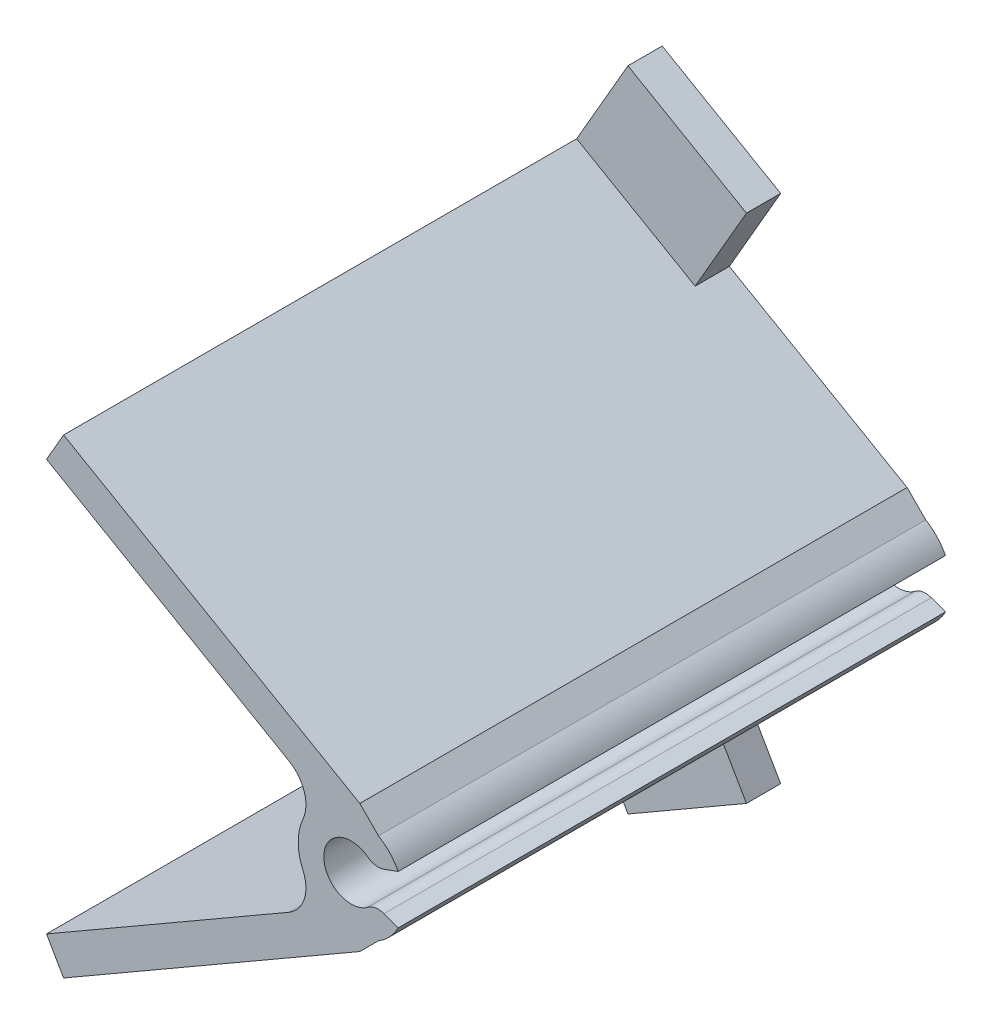
ISO-10303-21;
HEADER;
FILE_DESCRIPTION(('STEP AP214'),'2;1');
FILE_NAME('part.step','',(''),(''),'','','');
FILE_SCHEMA(('AUTOMOTIVE_DESIGN { 1 0 10303 214 1 1 1 1 }'));
ENDSEC;
DATA;
#1=APPLICATION_CONTEXT('core data for automotive mechanical design processes');
#2=APPLICATION_PROTOCOL_DEFINITION('international standard','automotive_design',2000,#1);
#3=PRODUCT_CONTEXT('',#1,'mechanical');
#4=PRODUCT('Part','Part','',(#3));
#5=PRODUCT_RELATED_PRODUCT_CATEGORY('part','',(#4));
#6=PRODUCT_DEFINITION_FORMATION('','',#4);
#7=PRODUCT_DEFINITION_CONTEXT('part definition',#1,'design');
#8=PRODUCT_DEFINITION('design','',#6,#7);
#9=PRODUCT_DEFINITION_SHAPE('','',#8);
#10=(LENGTH_UNIT() NAMED_UNIT(*) SI_UNIT(.MILLI.,.METRE.));
#11=(NAMED_UNIT(*) PLANE_ANGLE_UNIT() SI_UNIT($,.RADIAN.));
#12=(NAMED_UNIT(*) SI_UNIT($,.STERADIAN.) SOLID_ANGLE_UNIT());
#13=UNCERTAINTY_MEASURE_WITH_UNIT(LENGTH_MEASURE(1.E-05),#10,'distance_accuracy_value','');
#14=(GEOMETRIC_REPRESENTATION_CONTEXT(3) GLOBAL_UNCERTAINTY_ASSIGNED_CONTEXT((#13)) GLOBAL_UNIT_ASSIGNED_CONTEXT((#10,
#11,#12)) REPRESENTATION_CONTEXT('',''));
#15=CARTESIAN_POINT('',(0.,0.,0.));
#16=DIRECTION('',(0.,0.,1.));
#17=DIRECTION('',(1.,0.,0.));
#18=AXIS2_PLACEMENT_3D('',#15,#16,#17);
#19=CARTESIAN_POINT('',(0.,0.,16.));
#20=DIRECTION('',(0.,0.,-1.));
#21=DIRECTION('',(-1.,0.,0.));
#22=AXIS2_PLACEMENT_3D('',#19,#20,#21);
#23=CYLINDRICAL_SURFACE('',#22,1.55);
#24=CARTESIAN_POINT('',(0.,0.,0.));
#25=DIRECTION('',(0.,0.,1.));
#26=DIRECTION('',(1.,0.,0.));
#27=AXIS2_PLACEMENT_3D('',#24,#25,#26);
#28=CIRCLE('',#27,1.55);
#29=CARTESIAN_POINT('',(-1.41185311813905,0.639664578354184,0.));
#30=VERTEX_POINT('',#29);
#31=CARTESIAN_POINT('',(-1.41185311813906,-0.639664578354173,0.));
#32=VERTEX_POINT('',#31);
#33=EDGE_CURVE('E423',#30,#32,#28,.T.);
#34=ORIENTED_EDGE('',*,*,#33,.T.);
#35=DIRECTION('',(0.,0.,-1.));
#36=VECTOR('',#35,1.);
#37=CARTESIAN_POINT('',(-1.41185311813906,-0.639664578354173,16.));
#38=LINE('',#37,#36);
#39=CARTESIAN_POINT('',(-1.41185311813906,-0.639664578354173,16.));
#40=VERTEX_POINT('',#39);
#41=EDGE_CURVE('E452',#32,#40,#38,.F.);
#42=ORIENTED_EDGE('',*,*,#41,.T.);
#43=CARTESIAN_POINT('',(0.,0.,16.));
#44=DIRECTION('',(0.,0.,1.));
#45=DIRECTION('',(1.,0.,0.));
#46=AXIS2_PLACEMENT_3D('',#43,#44,#45);
#47=CIRCLE('',#46,1.55);
#48=CARTESIAN_POINT('',(-1.41185311813905,0.639664578354184,16.));
#49=VERTEX_POINT('',#48);
#50=EDGE_CURVE('E412',#49,#40,#47,.T.);
#51=ORIENTED_EDGE('',*,*,#50,.F.);
#52=DIRECTION('',(0.,0.,-1.));
#53=VECTOR('',#52,1.);
#54=CARTESIAN_POINT('',(-1.41185311813905,0.639664578354184,16.));
#55=LINE('',#54,#53);
#56=EDGE_CURVE('E449',#49,#30,#55,.T.);
#57=ORIENTED_EDGE('',*,*,#56,.T.);
#58=EDGE_LOOP('',(#34,#42,#51,#57));
#59=FACE_BOUND('',#58,.T.);
#60=ADVANCED_FACE('F35',(#59),#23,.T.);
#61=CARTESIAN_POINT('',(0.799999999999984,-1.32759180473519,16.));
#62=VERTEX_POINT('',#61);
#63=CARTESIAN_POINT('',(1.37594357438418,-0.713638059600869,16.));
#64=VERTEX_POINT('',#63);
#65=EDGE_CURVE('E408',#62,#64,#47,.T.);
#66=ORIENTED_EDGE('',*,*,#65,.F.);
#67=DIRECTION('',(0.,0.,-1.));
#68=VECTOR('',#67,1.);
#69=CARTESIAN_POINT('',(0.799999999999985,-1.32759180473518,16.));
#70=LINE('',#69,#68);
#71=CARTESIAN_POINT('',(0.799999999999984,-1.32759180473519,0.));
#72=VERTEX_POINT('',#71);
#73=EDGE_CURVE('E369',#62,#72,#70,.T.);
#74=ORIENTED_EDGE('',*,*,#73,.T.);
#75=CARTESIAN_POINT('',(1.37594357438418,-0.713638059600869,0.));
#76=VERTEX_POINT('',#75);
#77=EDGE_CURVE('E420',#72,#76,#28,.T.);
#78=ORIENTED_EDGE('',*,*,#77,.T.);
#79=DIRECTION('',(0.,0.,-1.));
#80=VECTOR('',#79,1.);
#81=CARTESIAN_POINT('',(1.37594357438418,-0.713638059600869,16.));
#82=LINE('',#81,#80);
#83=EDGE_CURVE('E415',#64,#76,#82,.T.);
#84=ORIENTED_EDGE('',*,*,#83,.F.);
#85=EDGE_LOOP('',(#66,#74,#78,#84));
#86=FACE_BOUND('',#85,.T.);
#87=ADVANCED_FACE('F489',(#86),#23,.T.);
#88=CARTESIAN_POINT('',(0.,0.,16.));
#89=DIRECTION('',(0.,0.,-1.));
#90=DIRECTION('',(-1.,0.,0.));
#91=AXIS2_PLACEMENT_3D('',#88,#89,#90);
#92=CYLINDRICAL_SURFACE('',#91,0.8);
#93=CARTESIAN_POINT('',(0.,0.,16.));
#94=DIRECTION('',(0.,0.,1.));
#95=DIRECTION('',(1.,0.,0.));
#96=AXIS2_PLACEMENT_3D('',#93,#94,#95);
#97=CIRCLE('',#96,0.8);
#98=CARTESIAN_POINT('',(0.486133901983514,0.635353310640846,16.));
#99=VERTEX_POINT('',#98);
#100=CARTESIAN_POINT('',(0.486133901983514,-0.635353310640846,16.));
#101=VERTEX_POINT('',#100);
#102=EDGE_CURVE('E402',#99,#101,#97,.T.);
#103=ORIENTED_EDGE('',*,*,#102,.T.);
#104=DIRECTION('',(0.,0.,-1.));
#105=VECTOR('',#104,1.);
#106=CARTESIAN_POINT('',(0.486133901983514,-0.635353310640846,16.));
#107=LINE('',#106,#105);
#108=CARTESIAN_POINT('',(0.486133901983514,-0.635353310640846,0.));
#109=VERTEX_POINT('',#108);
#110=EDGE_CURVE('E433',#101,#109,#107,.T.);
#111=ORIENTED_EDGE('',*,*,#110,.T.);
#112=CARTESIAN_POINT('',(0.,0.,0.));
#113=DIRECTION('',(0.,0.,1.));
#114=DIRECTION('',(1.,0.,0.));
#115=AXIS2_PLACEMENT_3D('',#112,#113,#114);
#116=CIRCLE('',#115,0.8);
#117=CARTESIAN_POINT('',(0.486133901983514,0.635353310640846,0.));
#118=VERTEX_POINT('',#117);
#119=EDGE_CURVE('E401',#118,#109,#116,.T.);
#120=ORIENTED_EDGE('',*,*,#119,.F.);
#121=DIRECTION('',(0.,0.,-1.));
#122=VECTOR('',#121,1.);
#123=CARTESIAN_POINT('',(0.486133901983514,0.635353310640846,16.));
#124=LINE('',#123,#122);
#125=EDGE_CURVE('E431',#118,#99,#124,.F.);
#126=ORIENTED_EDGE('',*,*,#125,.T.);
#127=EDGE_LOOP('',(#103,#111,#120,#126));
#128=FACE_BOUND('',#127,.T.);
#129=ADVANCED_FACE('F501',(#128),#92,.F.);
#130=CARTESIAN_POINT('',(-0.0684040286651341,0.187938524157182,16.));
#131=DIRECTION('',(-0.342020143325669,0.939692620785908,0.));
#132=DIRECTION('',(-0.939692620785908,-0.342020143325669,0.));
#133=AXIS2_PLACEMENT_3D('',#130,#131,#132);
#134=PLANE('',#133);
#135=DIRECTION('',(0.939692620785908,0.342020143325669,0.));
#136=VECTOR('',#135,1.);
#137=CARTESIAN_POINT('',(-0.0684040286651341,0.187938524157182,16.));
#138=LINE('',#137,#136);
#139=CARTESIAN_POINT('',(0.960977662386046,0.56260281939842,16.));
#140=VERTEX_POINT('',#139);
#141=CARTESIAN_POINT('',(1.37594357438418,0.713638059600869,16.));
#142=VERTEX_POINT('',#141);
#143=EDGE_CURVE('E405',#140,#142,#138,.T.);
#144=ORIENTED_EDGE('',*,*,#143,.F.);
#145=DIRECTION('',(0.,0.,1.));
#146=VECTOR('',#145,1.);
#147=CARTESIAN_POINT('',(0.960977662386045,0.56260281939842,0.));
#148=LINE('',#147,#146);
#149=CARTESIAN_POINT('',(0.960977662386046,0.56260281939842,0.));
#150=VERTEX_POINT('',#149);
#151=EDGE_CURVE('E446',#140,#150,#148,.F.);
#152=ORIENTED_EDGE('',*,*,#151,.T.);
#153=DIRECTION('',(0.939692620785908,0.342020143325669,0.));
#154=VECTOR('',#153,1.);
#155=CARTESIAN_POINT('',(-0.0684040286651341,0.187938524157182,0.));
#156=LINE('',#155,#154);
#157=CARTESIAN_POINT('',(1.37594357438418,0.713638059600869,0.));
#158=VERTEX_POINT('',#157);
#159=EDGE_CURVE('E418',#150,#158,#156,.T.);
#160=ORIENTED_EDGE('',*,*,#159,.T.);
#161=DIRECTION('',(0.,0.,-1.));
#162=VECTOR('',#161,1.);
#163=CARTESIAN_POINT('',(1.37594357438418,0.713638059600869,16.));
#164=LINE('',#163,#162);
#165=EDGE_CURVE('E428',#142,#158,#164,.T.);
#166=ORIENTED_EDGE('',*,*,#165,.F.);
#167=EDGE_LOOP('',(#144,#152,#160,#166));
#168=FACE_BOUND('',#167,.T.);
#169=ADVANCED_FACE('F512',(#168),#134,.F.);
#170=CARTESIAN_POINT('',(0.799999999999997,1.32759180473518,0.));
#171=VERTEX_POINT('',#170);
#172=EDGE_CURVE('E421',#158,#171,#28,.T.);
#173=ORIENTED_EDGE('',*,*,#172,.T.);
#174=DIRECTION('',(0.,0.,-1.));
#175=VECTOR('',#174,1.);
#176=CARTESIAN_POINT('',(0.799999999999997,1.32759180473518,16.));
#177=LINE('',#176,#175);
#178=CARTESIAN_POINT('',(0.799999999999997,1.32759180473518,16.));
#179=VERTEX_POINT('',#178);
#180=EDGE_CURVE('E383',#171,#179,#177,.F.);
#181=ORIENTED_EDGE('',*,*,#180,.T.);
#182=EDGE_CURVE('E409',#142,#179,#47,.T.);
#183=ORIENTED_EDGE('',*,*,#182,.F.);
#184=ORIENTED_EDGE('',*,*,#165,.T.);
#185=EDGE_LOOP('',(#173,#181,#183,#184));
#186=FACE_BOUND('',#185,.T.);
#187=ADVANCED_FACE('F518',(#186),#23,.T.);
#188=CARTESIAN_POINT('',(-0.0684040286651341,-0.187938524157182,16.));
#189=DIRECTION('',(-0.342020143325669,-0.939692620785908,0.));
#190=DIRECTION('',(0.939692620785908,-0.342020143325669,0.));
#191=AXIS2_PLACEMENT_3D('',#188,#189,#190);
#192=PLANE('',#191);
#193=DIRECTION('',(-0.939692620785908,0.342020143325669,0.));
#194=VECTOR('',#193,1.);
#195=CARTESIAN_POINT('',(-0.0684040286651341,-0.187938524157182,0.));
#196=LINE('',#195,#194);
#197=CARTESIAN_POINT('',(0.960977662386046,-0.56260281939842,0.));
#198=VERTEX_POINT('',#197);
#199=EDGE_CURVE('E406',#76,#198,#196,.T.);
#200=ORIENTED_EDGE('',*,*,#199,.T.);
#201=DIRECTION('',(0.,0.,1.));
#202=VECTOR('',#201,1.);
#203=CARTESIAN_POINT('',(0.960977662386045,-0.56260281939842,16.));
#204=LINE('',#203,#202);
#205=CARTESIAN_POINT('',(0.960977662386046,-0.56260281939842,16.));
#206=VERTEX_POINT('',#205);
#207=EDGE_CURVE('E440',#198,#206,#204,.T.);
#208=ORIENTED_EDGE('',*,*,#207,.T.);
#209=DIRECTION('',(-0.939692620785908,0.342020143325669,0.));
#210=VECTOR('',#209,1.);
#211=CARTESIAN_POINT('',(-0.0684040286651341,-0.187938524157182,16.));
#212=LINE('',#211,#210);
#213=EDGE_CURVE('E411',#64,#206,#212,.T.);
#214=ORIENTED_EDGE('',*,*,#213,.F.);
#215=ORIENTED_EDGE('',*,*,#83,.T.);
#216=EDGE_LOOP('',(#200,#208,#214,#215));
#217=FACE_BOUND('',#216,.T.);
#218=ADVANCED_FACE('F550',(#217),#192,.F.);
#219=CARTESIAN_POINT('',(0.,0.,16.));
#220=DIRECTION('',(0.,0.,1.));
#221=DIRECTION('',(1.,0.,0.));
#222=AXIS2_PLACEMENT_3D('',#219,#220,#221);
#223=PLANE('',#222);
#224=ORIENTED_EDGE('',*,*,#213,.T.);
#225=CARTESIAN_POINT('',(0.789967590723211,-1.03244912979137,16.));
#226=DIRECTION('',(0.,0.,1.));
#227=DIRECTION('',(1.,0.,0.));
#228=AXIS2_PLACEMENT_3D('',#225,#226,#227);
#229=CIRCLE('',#228,0.5);
#230=EDGE_CURVE('E444',#206,#101,#229,.T.);
#231=ORIENTED_EDGE('',*,*,#230,.T.);
#232=ORIENTED_EDGE('',*,*,#102,.F.);
#233=CARTESIAN_POINT('',(0.789967590723211,1.03244912979137,16.));
#234=DIRECTION('',(0.,0.,1.));
#235=DIRECTION('',(1.,0.,0.));
#236=AXIS2_PLACEMENT_3D('',#233,#234,#235);
#237=CIRCLE('',#236,0.5);
#238=EDGE_CURVE('E442',#99,#140,#237,.T.);
#239=ORIENTED_EDGE('',*,*,#238,.T.);
#240=ORIENTED_EDGE('',*,*,#143,.T.);
#241=ORIENTED_EDGE('',*,*,#182,.T.);
#242=DIRECTION('',(-0.707106781186548,0.707106781186547,0.));
#243=VECTOR('',#242,1.);
#244=CARTESIAN_POINT('',(0.252847345641509,1.87474445909366,16.));
#245=LINE('',#244,#243);
#246=CARTESIAN_POINT('',(0.252847345641509,1.87474445909366,16.));
#247=VERTEX_POINT('',#246);
#248=EDGE_CURVE('E385',#179,#247,#245,.T.);
#249=ORIENTED_EDGE('',*,*,#248,.T.);
#250=DIRECTION('',(-0.866025403784442,0.499999999999995,0.));
#251=VECTOR('',#250,1.);
#252=CARTESIAN_POINT('',(-8.40740669220291,6.87474445909361,16.));
#253=LINE('',#252,#251);
#254=CARTESIAN_POINT('',(-8.40740669220291,6.87474445909361,16.));
#255=VERTEX_POINT('',#254);
#256=EDGE_CURVE('E387',#247,#255,#253,.T.);
#257=ORIENTED_EDGE('',*,*,#256,.T.);
#258=DIRECTION('',(-0.49999999999997,-0.866025403784456,0.));
#259=VECTOR('',#258,1.);
#260=CARTESIAN_POINT('',(-8.90740669220288,6.00871905530915,16.));
#261=LINE('',#260,#259);
#262=CARTESIAN_POINT('',(-8.90740669220288,6.00871905530915,16.));
#263=VERTEX_POINT('',#262);
#264=EDGE_CURVE('E390',#255,#263,#261,.T.);
#265=ORIENTED_EDGE('',*,*,#264,.T.);
#266=DIRECTION('',(0.866025403784442,-0.499999999999994,0.));
#267=VECTOR('',#266,1.);
#268=CARTESIAN_POINT('',(-8.90740669220288,6.00871905530915,16.));
#269=LINE('',#268,#267);
#270=CARTESIAN_POINT('',(-1.82272609758361,1.91837680688326,16.));
#271=VERTEX_POINT('',#270);
#272=EDGE_CURVE('E372',#263,#271,#269,.T.);
#273=ORIENTED_EDGE('',*,*,#272,.T.);
#274=CARTESIAN_POINT('',(-2.3227260975836,1.05235140309882,16.));
#275=DIRECTION('',(0.,0.,1.));
#276=DIRECTION('',(1.,0.,0.));
#277=AXIS2_PLACEMENT_3D('',#274,#275,#276);
#278=CIRCLE('',#277,1.);
#279=EDGE_CURVE('E11',#271,#49,#278,.F.);
#280=ORIENTED_EDGE('',*,*,#279,.T.);
#281=ORIENTED_EDGE('',*,*,#50,.T.);
#282=CARTESIAN_POINT('',(-2.32272609758361,-1.0523514030988,16.));
#283=DIRECTION('',(0.,0.,1.));
#284=DIRECTION('',(1.,0.,0.));
#285=AXIS2_PLACEMENT_3D('',#282,#283,#284);
#286=CIRCLE('',#285,1.);
#287=CARTESIAN_POINT('',(-1.82272609758361,-1.91837680688324,16.));
#288=VERTEX_POINT('',#287);
#289=EDGE_CURVE('E458',#40,#288,#286,.F.);
#290=ORIENTED_EDGE('',*,*,#289,.T.);
#291=DIRECTION('',(-0.86602540378444,-0.499999999999997,0.));
#292=VECTOR('',#291,1.);
#293=CARTESIAN_POINT('',(-8.90740669220292,-6.00871905530918,16.));
#294=LINE('',#293,#292);
#295=CARTESIAN_POINT('',(-8.90740669220292,-6.00871905530918,16.));
#296=VERTEX_POINT('',#295);
#297=EDGE_CURVE('E339',#288,#296,#294,.T.);
#298=ORIENTED_EDGE('',*,*,#297,.T.);
#299=DIRECTION('',(0.499999999999975,-0.866025403784453,0.));
#300=VECTOR('',#299,1.);
#301=CARTESIAN_POINT('',(-8.90740669220292,-6.00871905530918,16.));
#302=LINE('',#301,#300);
#303=CARTESIAN_POINT('',(-8.40740669220294,-6.87474445909363,16.));
#304=VERTEX_POINT('',#303);
#305=EDGE_CURVE('E355',#296,#304,#302,.T.);
#306=ORIENTED_EDGE('',*,*,#305,.T.);
#307=DIRECTION('',(0.866025403784442,0.499999999999995,0.));
#308=VECTOR('',#307,1.);
#309=CARTESIAN_POINT('',(-8.40740669220294,-6.87474445909363,16.));
#310=LINE('',#309,#308);
#311=CARTESIAN_POINT('',(0.252847345641476,-1.87474445909369,16.));
#312=VERTEX_POINT('',#311);
#313=EDGE_CURVE('E358',#304,#312,#310,.T.);
#314=ORIENTED_EDGE('',*,*,#313,.T.);
#315=DIRECTION('',(0.707106781186552,0.707106781186543,0.));
#316=VECTOR('',#315,1.);
#317=CARTESIAN_POINT('',(0.252847345641476,-1.87474445909369,16.));
#318=LINE('',#317,#316);
#319=EDGE_CURVE('E361',#312,#62,#318,.T.);
#320=ORIENTED_EDGE('',*,*,#319,.T.);
#321=ORIENTED_EDGE('',*,*,#65,.T.);
#322=EDGE_LOOP('',(#224,#231,#232,#239,#240,#241,#249,#257,#265,#273,#280,#281,#290,#298,#306,
#314,#320,#321));
#323=FACE_BOUND('',#322,.T.);
#324=ADVANCED_FACE('F474',(#323),#223,.T.);
#325=CARTESIAN_POINT('',(0.,0.,0.));
#326=DIRECTION('',(0.,0.,1.));
#327=DIRECTION('',(1.,0.,0.));
#328=AXIS2_PLACEMENT_3D('',#325,#326,#327);
#329=PLANE('',#328);
#330=ORIENTED_EDGE('',*,*,#119,.T.);
#331=CARTESIAN_POINT('',(0.789967590723211,-1.03244912979137,0.));
#332=DIRECTION('',(0.,0.,1.));
#333=DIRECTION('',(1.,0.,0.));
#334=AXIS2_PLACEMENT_3D('',#331,#332,#333);
#335=CIRCLE('',#334,0.5);
#336=EDGE_CURVE('E438',#109,#198,#335,.F.);
#337=ORIENTED_EDGE('',*,*,#336,.T.);
#338=ORIENTED_EDGE('',*,*,#199,.F.);
#339=ORIENTED_EDGE('',*,*,#77,.F.);
#340=DIRECTION('',(-0.707106781186552,-0.707106781186543,0.));
#341=VECTOR('',#340,1.);
#342=CARTESIAN_POINT('',(0.252847345641476,-1.87474445909369,0.));
#343=LINE('',#342,#341);
#344=CARTESIAN_POINT('',(0.252847345641474,-1.87474445909369,0.));
#345=VERTEX_POINT('',#344);
#346=EDGE_CURVE('E347',#72,#345,#343,.T.);
#347=ORIENTED_EDGE('',*,*,#346,.T.);
#348=DIRECTION('',(-0.866025403784442,-0.499999999999995,0.));
#349=VECTOR('',#348,1.);
#350=CARTESIAN_POINT('',(-8.40740669220294,-6.87474445909363,0.));
#351=LINE('',#350,#349);
#352=CARTESIAN_POINT('',(-4.94330507706516,-4.87474445909361,0.));
#353=VERTEX_POINT('',#352);
#354=EDGE_CURVE('E344',#345,#353,#351,.T.);
#355=ORIENTED_EDGE('',*,*,#354,.T.);
#356=DIRECTION('',(0.5,-0.866025403784439,0.));
#357=VECTOR('',#356,1.);
#358=CARTESIAN_POINT('',(-4.94330507706516,-4.87474445909361,0.));
#359=LINE('',#358,#357);
#360=CARTESIAN_POINT('',(-3.44330507706516,-7.47282067044693,0.));
#361=VERTEX_POINT('',#360);
#362=EDGE_CURVE('E290',#353,#361,#359,.T.);
#363=ORIENTED_EDGE('',*,*,#362,.T.);
#364=DIRECTION('',(-0.866025403784439,-0.5,0.));
#365=VECTOR('',#364,1.);
#366=CARTESIAN_POINT('',(-6.90740669220291,-9.47282067044693,0.));
#367=LINE('',#366,#365);
#368=CARTESIAN_POINT('',(-6.90740669220291,-9.47282067044693,0.));
#369=VERTEX_POINT('',#368);
#370=EDGE_CURVE('E298',#361,#369,#367,.T.);
#371=ORIENTED_EDGE('',*,*,#370,.T.);
#372=DIRECTION('',(-0.499999999999975,0.866025403784453,0.));
#373=VECTOR('',#372,1.);
#374=CARTESIAN_POINT('',(-8.90740669220292,-6.00871905530918,0.));
#375=LINE('',#374,#373);
#376=CARTESIAN_POINT('',(-9.40740669220291,-5.14269365152473,0.));
#377=VERTEX_POINT('',#376);
#378=EDGE_CURVE('E353',#369,#377,#375,.T.);
#379=ORIENTED_EDGE('',*,*,#378,.T.);
#380=DIRECTION('',(0.866025403784439,0.5,0.));
#381=VECTOR('',#380,1.);
#382=CARTESIAN_POINT('',(-9.40740669220291,-5.14269365152473,0.));
#383=LINE('',#382,#381);
#384=CARTESIAN_POINT('',(-7.67535588463403,-4.14269365152473,0.));
#385=VERTEX_POINT('',#384);
#386=EDGE_CURVE('E237',#377,#385,#383,.T.);
#387=ORIENTED_EDGE('',*,*,#386,.T.);
#388=DIRECTION('',(0.5,-0.866025403784438,0.));
#389=VECTOR('',#388,1.);
#390=CARTESIAN_POINT('',(-7.17535588463401,-5.0087190553092,0.));
#391=LINE('',#390,#389);
#392=CARTESIAN_POINT('',(-7.17535588463401,-5.00871905530917,0.));
#393=VERTEX_POINT('',#392);
#394=EDGE_CURVE('E257',#385,#393,#391,.T.);
#395=ORIENTED_EDGE('',*,*,#394,.T.);
#396=DIRECTION('',(0.86602540378444,0.499999999999997,0.));
#397=VECTOR('',#396,1.);
#398=CARTESIAN_POINT('',(-8.90740669220292,-6.00871905530918,0.));
#399=LINE('',#398,#397);
#400=CARTESIAN_POINT('',(-1.82272609758361,-1.91837680688324,0.));
#401=VERTEX_POINT('',#400);
#402=EDGE_CURVE('E350',#393,#401,#399,.T.);
#403=ORIENTED_EDGE('',*,*,#402,.T.);
#404=CARTESIAN_POINT('',(-2.32272609758361,-1.0523514030988,0.));
#405=DIRECTION('',(0.,0.,1.));
#406=DIRECTION('',(1.,0.,0.));
#407=AXIS2_PLACEMENT_3D('',#404,#405,#406);
#408=CIRCLE('',#407,1.);
#409=EDGE_CURVE('E460',#401,#32,#408,.T.);
#410=ORIENTED_EDGE('',*,*,#409,.T.);
#411=ORIENTED_EDGE('',*,*,#33,.F.);
#412=CARTESIAN_POINT('',(-2.3227260975836,1.05235140309882,0.));
#413=DIRECTION('',(0.,0.,1.));
#414=DIRECTION('',(1.,0.,0.));
#415=AXIS2_PLACEMENT_3D('',#412,#413,#414);
#416=CIRCLE('',#415,1.);
#417=CARTESIAN_POINT('',(-1.8227260975836,1.91837680688326,0.));
#418=VERTEX_POINT('',#417);
#419=EDGE_CURVE('E43',#30,#418,#416,.T.);
#420=ORIENTED_EDGE('',*,*,#419,.T.);
#421=DIRECTION('',(-0.866025403784442,0.499999999999994,0.));
#422=VECTOR('',#421,1.);
#423=CARTESIAN_POINT('',(-8.90740669220288,6.00871905530915,0.));
#424=LINE('',#423,#422);
#425=CARTESIAN_POINT('',(-7.17535588463401,5.0087190553092,0.));
#426=VERTEX_POINT('',#425);
#427=EDGE_CURVE('E381',#418,#426,#424,.T.);
#428=ORIENTED_EDGE('',*,*,#427,.T.);
#429=DIRECTION('',(-0.5,-0.866025403784438,0.));
#430=VECTOR('',#429,1.);
#431=CARTESIAN_POINT('',(-7.17535588463401,5.0087190553092,0.));
#432=LINE('',#431,#430);
#433=CARTESIAN_POINT('',(-7.67535588463403,4.14269365152473,0.));
#434=VERTEX_POINT('',#433);
#435=EDGE_CURVE('E268',#426,#434,#432,.T.);
#436=ORIENTED_EDGE('',*,*,#435,.T.);
#437=DIRECTION('',(-0.866025403784439,0.5,0.));
#438=VECTOR('',#437,1.);
#439=CARTESIAN_POINT('',(-9.40740669220291,5.14269365152473,0.));
#440=LINE('',#439,#438);
#441=CARTESIAN_POINT('',(-9.40740669220291,5.14269365152473,0.));
#442=VERTEX_POINT('',#441);
#443=EDGE_CURVE('E273',#434,#442,#440,.T.);
#444=ORIENTED_EDGE('',*,*,#443,.T.);
#445=DIRECTION('',(0.499999999999971,0.866025403784456,0.));
#446=VECTOR('',#445,1.);
#447=CARTESIAN_POINT('',(-8.90740669220288,6.00871905530915,0.));
#448=LINE('',#447,#446);
#449=CARTESIAN_POINT('',(-6.90740669220291,9.47282067044693,0.));
#450=VERTEX_POINT('',#449);
#451=EDGE_CURVE('E379',#442,#450,#448,.T.);
#452=ORIENTED_EDGE('',*,*,#451,.T.);
#453=DIRECTION('',(0.866025403784439,-0.5,0.));
#454=VECTOR('',#453,1.);
#455=CARTESIAN_POINT('',(-6.90740669220291,9.47282067044693,0.));
#456=LINE('',#455,#454);
#457=CARTESIAN_POINT('',(-3.44330507706516,7.47282067044693,0.));
#458=VERTEX_POINT('',#457);
#459=EDGE_CURVE('E315',#450,#458,#456,.T.);
#460=ORIENTED_EDGE('',*,*,#459,.T.);
#461=DIRECTION('',(-0.5,-0.866025403784439,0.));
#462=VECTOR('',#461,1.);
#463=CARTESIAN_POINT('',(-4.94330507706516,4.87474445909361,0.));
#464=LINE('',#463,#462);
#465=CARTESIAN_POINT('',(-4.94330507706511,4.87474445909361,0.));
#466=VERTEX_POINT('',#465);
#467=EDGE_CURVE('E324',#458,#466,#464,.T.);
#468=ORIENTED_EDGE('',*,*,#467,.T.);
#469=DIRECTION('',(0.866025403784442,-0.499999999999995,0.));
#470=VECTOR('',#469,1.);
#471=CARTESIAN_POINT('',(-8.40740669220291,6.87474445909361,0.));
#472=LINE('',#471,#470);
#473=CARTESIAN_POINT('',(0.252847345641509,1.87474445909366,0.));
#474=VERTEX_POINT('',#473);
#475=EDGE_CURVE('E376',#466,#474,#472,.T.);
#476=ORIENTED_EDGE('',*,*,#475,.T.);
#477=DIRECTION('',(0.707106781186548,-0.707106781186547,0.));
#478=VECTOR('',#477,1.);
#479=CARTESIAN_POINT('',(0.252847345641509,1.87474445909366,0.));
#480=LINE('',#479,#478);
#481=EDGE_CURVE('E373',#474,#171,#480,.T.);
#482=ORIENTED_EDGE('',*,*,#481,.T.);
#483=ORIENTED_EDGE('',*,*,#172,.F.);
#484=ORIENTED_EDGE('',*,*,#159,.F.);
#485=CARTESIAN_POINT('',(0.789967590723211,1.03244912979137,0.));
#486=DIRECTION('',(0.,0.,1.));
#487=DIRECTION('',(1.,0.,0.));
#488=AXIS2_PLACEMENT_3D('',#485,#486,#487);
#489=CIRCLE('',#488,0.5);
#490=EDGE_CURVE('E436',#150,#118,#489,.F.);
#491=ORIENTED_EDGE('',*,*,#490,.T.);
#492=EDGE_LOOP('',(#330,#337,#338,#339,#347,#355,#363,#371,#379,#387,#395,#403,#410,#411,#420,
#428,#436,#444,#452,#460,#468,#476,#482,#483,#484,#491));
#493=FACE_BOUND('',#492,.T.);
#494=ADVANCED_FACE('F463',(#493),#329,.F.);
#495=CARTESIAN_POINT('',(-8.90740669220288,6.00871905530915,-11.9020046410516));
#496=DIRECTION('',(-0.499999999999994,-0.866025403784442,0.));
#497=DIRECTION('',(0.866025403784442,-0.499999999999994,0.));
#498=AXIS2_PLACEMENT_3D('',#495,#496,#497);
#499=PLANE('',#498);
#500=ORIENTED_EDGE('',*,*,#427,.F.);
#501=DIRECTION('',(0.,0.,-1.));
#502=VECTOR('',#501,1.);
#503=CARTESIAN_POINT('',(-1.82272609758361,1.91837680688326,-11.9020046410516));
#504=LINE('',#503,#502);
#505=EDGE_CURVE('E50',#418,#271,#504,.F.);
#506=ORIENTED_EDGE('',*,*,#505,.T.);
#507=ORIENTED_EDGE('',*,*,#272,.F.);
#508=DIRECTION('',(0.,0.,1.));
#509=VECTOR('',#508,1.);
#510=CARTESIAN_POINT('',(-8.90740669220288,6.00871905530915,-11.9020046410516));
#511=LINE('',#510,#509);
#512=CARTESIAN_POINT('',(-8.90740669220288,6.00871905530915,1.));
#513=VERTEX_POINT('',#512);
#514=EDGE_CURVE('E377',#513,#263,#511,.T.);
#515=ORIENTED_EDGE('',*,*,#514,.F.);
#516=DIRECTION('',(0.866025403784448,-0.499999999999984,0.));
#517=VECTOR('',#516,1.);
#518=CARTESIAN_POINT('',(-8.90740669220288,6.00871905530915,1.));
#519=LINE('',#518,#517);
#520=CARTESIAN_POINT('',(-7.17535588463401,5.0087190553092,1.));
#521=VERTEX_POINT('',#520);
#522=EDGE_CURVE('E272',#513,#521,#519,.T.);
#523=ORIENTED_EDGE('',*,*,#522,.T.);
#524=DIRECTION('',(0.,0.,-1.));
#525=VECTOR('',#524,1.);
#526=CARTESIAN_POINT('',(-7.17535588463401,5.0087190553092,1.));
#527=LINE('',#526,#525);
#528=EDGE_CURVE('E282',#521,#426,#527,.T.);
#529=ORIENTED_EDGE('',*,*,#528,.T.);
#530=EDGE_LOOP('',(#500,#506,#507,#515,#523,#529));
#531=FACE_BOUND('',#530,.T.);
#532=ADVANCED_FACE('F535',(#531),#499,.T.);
#533=CARTESIAN_POINT('',(0.252847345641509,1.87474445909366,-11.9020046410516));
#534=DIRECTION('',(0.707106781186547,0.707106781186548,0.));
#535=DIRECTION('',(-0.707106781186548,0.707106781186547,0.));
#536=AXIS2_PLACEMENT_3D('',#533,#534,#535);
#537=PLANE('',#536);
#538=ORIENTED_EDGE('',*,*,#180,.F.);
#539=ORIENTED_EDGE('',*,*,#481,.F.);
#540=DIRECTION('',(0.,0.,1.));
#541=VECTOR('',#540,1.);
#542=CARTESIAN_POINT('',(0.252847345641509,1.87474445909366,-11.9020046410516));
#543=LINE('',#542,#541);
#544=EDGE_CURVE('E393',#474,#247,#543,.T.);
#545=ORIENTED_EDGE('',*,*,#544,.T.);
#546=ORIENTED_EDGE('',*,*,#248,.F.);
#547=EDGE_LOOP('',(#538,#539,#545,#546));
#548=FACE_BOUND('',#547,.T.);
#549=ADVANCED_FACE('F521',(#548),#537,.T.);
#550=CARTESIAN_POINT('',(-8.90740669220288,6.00871905530915,-11.9020046410516));
#551=DIRECTION('',(-0.866025403784456,0.49999999999997,0.));
#552=DIRECTION('',(-0.499999999999971,-0.866025403784456,0.));
#553=AXIS2_PLACEMENT_3D('',#550,#551,#552);
#554=PLANE('',#553);
#555=ORIENTED_EDGE('',*,*,#451,.F.);
#556=DIRECTION('',(0.,0.,-1.));
#557=VECTOR('',#556,1.);
#558=CARTESIAN_POINT('',(-9.40740669220291,5.14269365152473,1.));
#559=LINE('',#558,#557);
#560=CARTESIAN_POINT('',(-9.40740669220291,5.14269365152473,1.));
#561=VERTEX_POINT('',#560);
#562=EDGE_CURVE('E287',#561,#442,#559,.T.);
#563=ORIENTED_EDGE('',*,*,#562,.F.);
#564=DIRECTION('',(0.500000000000031,0.86602540378442,0.));
#565=VECTOR('',#564,1.);
#566=CARTESIAN_POINT('',(-8.90740669220288,6.00871905530915,1.));
#567=LINE('',#566,#565);
#568=EDGE_CURVE('E270',#561,#513,#567,.T.);
#569=ORIENTED_EDGE('',*,*,#568,.T.);
#570=ORIENTED_EDGE('',*,*,#514,.T.);
#571=ORIENTED_EDGE('',*,*,#264,.F.);
#572=DIRECTION('',(0.,0.,1.));
#573=VECTOR('',#572,1.);
#574=CARTESIAN_POINT('',(-8.40740669220291,6.87474445909361,-11.9020046410516));
#575=LINE('',#574,#573);
#576=CARTESIAN_POINT('',(-8.40740669220291,6.87474445909361,1.));
#577=VERTEX_POINT('',#576);
#578=EDGE_CURVE('E395',#577,#255,#575,.T.);
#579=ORIENTED_EDGE('',*,*,#578,.F.);
#580=DIRECTION('',(0.499999999999998,0.86602540378444,0.));
#581=VECTOR('',#580,1.);
#582=CARTESIAN_POINT('',(-8.40740669220291,6.87474445909361,1.));
#583=LINE('',#582,#581);
#584=CARTESIAN_POINT('',(-6.90740669220291,9.47282067044693,1.));
#585=VERTEX_POINT('',#584);
#586=EDGE_CURVE('E320',#577,#585,#583,.T.);
#587=ORIENTED_EDGE('',*,*,#586,.T.);
#588=DIRECTION('',(0.,0.,-1.));
#589=VECTOR('',#588,1.);
#590=CARTESIAN_POINT('',(-6.90740669220291,9.47282067044693,1.));
#591=LINE('',#590,#589);
#592=EDGE_CURVE('E332',#585,#450,#591,.T.);
#593=ORIENTED_EDGE('',*,*,#592,.T.);
#594=EDGE_LOOP('',(#555,#563,#569,#570,#571,#579,#587,#593));
#595=FACE_BOUND('',#594,.T.);
#596=ADVANCED_FACE('F531',(#595),#554,.T.);
#597=CARTESIAN_POINT('',(-8.40740669220291,6.87474445909361,-11.9020046410516));
#598=DIRECTION('',(0.499999999999995,0.866025403784442,0.));
#599=DIRECTION('',(-0.866025403784442,0.499999999999995,0.));
#600=AXIS2_PLACEMENT_3D('',#597,#598,#599);
#601=PLANE('',#600);
#602=DIRECTION('',(0.,0.,-1.));
#603=VECTOR('',#602,1.);
#604=CARTESIAN_POINT('',(-4.94330507706516,4.87474445909361,1.));
#605=LINE('',#604,#603);
#606=CARTESIAN_POINT('',(-4.94330507706516,4.87474445909361,1.));
#607=VERTEX_POINT('',#606);
#608=EDGE_CURVE('E336',#607,#466,#605,.T.);
#609=ORIENTED_EDGE('',*,*,#608,.F.);
#610=DIRECTION('',(-0.866025403784438,0.5,0.));
#611=VECTOR('',#610,1.);
#612=CARTESIAN_POINT('',(-8.40740669220291,6.87474445909361,1.));
#613=LINE('',#612,#611);
#614=EDGE_CURVE('E329',#607,#577,#613,.T.);
#615=ORIENTED_EDGE('',*,*,#614,.T.);
#616=ORIENTED_EDGE('',*,*,#578,.T.);
#617=ORIENTED_EDGE('',*,*,#256,.F.);
#618=ORIENTED_EDGE('',*,*,#544,.F.);
#619=ORIENTED_EDGE('',*,*,#475,.F.);
#620=EDGE_LOOP('',(#609,#615,#616,#617,#618,#619));
#621=FACE_BOUND('',#620,.T.);
#622=ADVANCED_FACE('F527',(#621),#601,.T.);
#623=CARTESIAN_POINT('',(-8.90740669220292,-6.00871905530918,-11.9020046410516));
#624=DIRECTION('',(-0.499999999999997,0.86602540378444,0.));
#625=DIRECTION('',(-0.86602540378444,-0.499999999999997,0.));
#626=AXIS2_PLACEMENT_3D('',#623,#624,#625);
#627=PLANE('',#626);
#628=ORIENTED_EDGE('',*,*,#297,.F.);
#629=DIRECTION('',(0.,0.,-1.));
#630=VECTOR('',#629,1.);
#631=CARTESIAN_POINT('',(-1.82272609758361,-1.91837680688324,-11.9020046410516));
#632=LINE('',#631,#630);
#633=EDGE_CURVE('E455',#288,#401,#632,.T.);
#634=ORIENTED_EDGE('',*,*,#633,.T.);
#635=ORIENTED_EDGE('',*,*,#402,.F.);
#636=DIRECTION('',(0.,0.,-1.));
#637=VECTOR('',#636,1.);
#638=CARTESIAN_POINT('',(-7.17535588463401,-5.0087190553092,1.));
#639=LINE('',#638,#637);
#640=CARTESIAN_POINT('',(-7.17535588463401,-5.00871905530917,1.));
#641=VERTEX_POINT('',#640);
#642=EDGE_CURVE('E265',#641,#393,#639,.T.);
#643=ORIENTED_EDGE('',*,*,#642,.F.);
#644=DIRECTION('',(-0.866025403784448,-0.499999999999984,0.));
#645=VECTOR('',#644,1.);
#646=CARTESIAN_POINT('',(-8.90740669220288,-6.00871905530915,1.));
#647=LINE('',#646,#645);
#648=CARTESIAN_POINT('',(-8.90740669220288,-6.00871905530915,1.));
#649=VERTEX_POINT('',#648);
#650=EDGE_CURVE('E241',#641,#649,#647,.T.);
#651=ORIENTED_EDGE('',*,*,#650,.T.);
#652=DIRECTION('',(0.,0.,1.));
#653=VECTOR('',#652,1.);
#654=CARTESIAN_POINT('',(-8.90740669220292,-6.00871905530918,-11.9020046410516));
#655=LINE('',#654,#653);
#656=EDGE_CURVE('E255',#649,#296,#655,.T.);
#657=ORIENTED_EDGE('',*,*,#656,.T.);
#658=EDGE_LOOP('',(#628,#634,#635,#643,#651,#657));
#659=FACE_BOUND('',#658,.T.);
#660=ADVANCED_FACE('F476',(#659),#627,.T.);
#661=CARTESIAN_POINT('',(0.252847345641476,-1.87474445909369,-11.9020046410516));
#662=DIRECTION('',(0.707106781186543,-0.707106781186552,0.));
#663=DIRECTION('',(0.707106781186552,0.707106781186543,0.));
#664=AXIS2_PLACEMENT_3D('',#661,#662,#663);
#665=PLANE('',#664);
#666=ORIENTED_EDGE('',*,*,#73,.F.);
#667=ORIENTED_EDGE('',*,*,#319,.F.);
#668=DIRECTION('',(0.,0.,1.));
#669=VECTOR('',#668,1.);
#670=CARTESIAN_POINT('',(0.252847345641476,-1.87474445909369,-11.9020046410516));
#671=LINE('',#670,#669);
#672=EDGE_CURVE('E348',#345,#312,#671,.T.);
#673=ORIENTED_EDGE('',*,*,#672,.F.);
#674=ORIENTED_EDGE('',*,*,#346,.F.);
#675=EDGE_LOOP('',(#666,#667,#673,#674));
#676=FACE_BOUND('',#675,.T.);
#677=ADVANCED_FACE('F487',(#676),#665,.T.);
#678=CARTESIAN_POINT('',(-8.40740669220294,-6.87474445909363,-11.9020046410516));
#679=DIRECTION('',(0.499999999999995,-0.866025403784442,0.));
#680=DIRECTION('',(0.866025403784442,0.499999999999995,0.));
#681=AXIS2_PLACEMENT_3D('',#678,#679,#680);
#682=PLANE('',#681);
#683=DIRECTION('',(0.,0.,-1.));
#684=VECTOR('',#683,1.);
#685=CARTESIAN_POINT('',(-4.94330507706516,-4.87474445909361,1.));
#686=LINE('',#685,#684);
#687=CARTESIAN_POINT('',(-4.94330507706516,-4.87474445909361,1.));
#688=VERTEX_POINT('',#687);
#689=EDGE_CURVE('E307',#688,#353,#686,.T.);
#690=ORIENTED_EDGE('',*,*,#689,.T.);
#691=ORIENTED_EDGE('',*,*,#354,.F.);
#692=ORIENTED_EDGE('',*,*,#672,.T.);
#693=ORIENTED_EDGE('',*,*,#313,.F.);
#694=DIRECTION('',(0.,0.,1.));
#695=VECTOR('',#694,1.);
#696=CARTESIAN_POINT('',(-8.40740669220294,-6.87474445909363,-11.9020046410516));
#697=LINE('',#696,#695);
#698=CARTESIAN_POINT('',(-8.40740669220294,-6.87474445909363,1.));
#699=VERTEX_POINT('',#698);
#700=EDGE_CURVE('E365',#699,#304,#697,.T.);
#701=ORIENTED_EDGE('',*,*,#700,.F.);
#702=DIRECTION('',(0.866025403784438,0.5,0.));
#703=VECTOR('',#702,1.);
#704=CARTESIAN_POINT('',(-8.40740669220291,-6.87474445909361,1.));
#705=LINE('',#704,#703);
#706=EDGE_CURVE('E297',#699,#688,#705,.T.);
#707=ORIENTED_EDGE('',*,*,#706,.T.);
#708=EDGE_LOOP('',(#690,#691,#692,#693,#701,#707));
#709=FACE_BOUND('',#708,.T.);
#710=ADVANCED_FACE('F481',(#709),#682,.T.);
#711=CARTESIAN_POINT('',(-8.90740669220292,-6.00871905530918,-11.9020046410516));
#712=DIRECTION('',(-0.866025403784453,-0.499999999999975,0.));
#713=DIRECTION('',(0.499999999999975,-0.866025403784453,0.));
#714=AXIS2_PLACEMENT_3D('',#711,#712,#713);
#715=PLANE('',#714);
#716=ORIENTED_EDGE('',*,*,#378,.F.);
#717=DIRECTION('',(0.,0.,-1.));
#718=VECTOR('',#717,1.);
#719=CARTESIAN_POINT('',(-6.90740669220291,-9.47282067044693,1.));
#720=LINE('',#719,#718);
#721=CARTESIAN_POINT('',(-6.90740669220291,-9.47282067044693,1.));
#722=VERTEX_POINT('',#721);
#723=EDGE_CURVE('E312',#722,#369,#720,.T.);
#724=ORIENTED_EDGE('',*,*,#723,.F.);
#725=DIRECTION('',(-0.499999999999998,0.86602540378444,0.));
#726=VECTOR('',#725,1.);
#727=CARTESIAN_POINT('',(-8.40740669220291,-6.87474445909361,1.));
#728=LINE('',#727,#726);
#729=EDGE_CURVE('E295',#722,#699,#728,.T.);
#730=ORIENTED_EDGE('',*,*,#729,.T.);
#731=ORIENTED_EDGE('',*,*,#700,.T.);
#732=ORIENTED_EDGE('',*,*,#305,.F.);
#733=ORIENTED_EDGE('',*,*,#656,.F.);
#734=DIRECTION('',(-0.500000000000031,0.86602540378442,0.));
#735=VECTOR('',#734,1.);
#736=CARTESIAN_POINT('',(-8.90740669220288,-6.00871905530915,1.));
#737=LINE('',#736,#735);
#738=CARTESIAN_POINT('',(-9.40740669220291,-5.14269365152473,1.));
#739=VERTEX_POINT('',#738);
#740=EDGE_CURVE('E248',#649,#739,#737,.T.);
#741=ORIENTED_EDGE('',*,*,#740,.T.);
#742=DIRECTION('',(0.,0.,-1.));
#743=VECTOR('',#742,1.);
#744=CARTESIAN_POINT('',(-9.40740669220291,-5.14269365152473,1.));
#745=LINE('',#744,#743);
#746=EDGE_CURVE('E232',#739,#377,#745,.T.);
#747=ORIENTED_EDGE('',*,*,#746,.T.);
#748=EDGE_LOOP('',(#716,#724,#730,#731,#732,#733,#741,#747));
#749=FACE_BOUND('',#748,.T.);
#750=ADVANCED_FACE('F252',(#749),#715,.T.);
#751=CARTESIAN_POINT('',(0.789967590723211,-1.03244912979137,16.));
#752=DIRECTION('',(0.,0.,-1.));
#753=DIRECTION('',(-1.,0.,0.));
#754=AXIS2_PLACEMENT_3D('',#751,#752,#753);
#755=CYLINDRICAL_SURFACE('',#754,0.5);
#756=ORIENTED_EDGE('',*,*,#230,.F.);
#757=ORIENTED_EDGE('',*,*,#207,.F.);
#758=ORIENTED_EDGE('',*,*,#336,.F.);
#759=ORIENTED_EDGE('',*,*,#110,.F.);
#760=EDGE_LOOP('',(#756,#757,#758,#759));
#761=FACE_BOUND('',#760,.T.);
#762=ADVANCED_FACE('F498',(#761),#755,.T.);
#763=CARTESIAN_POINT('',(0.789967590723211,1.03244912979137,16.));
#764=DIRECTION('',(0.,0.,-1.));
#765=DIRECTION('',(-1.,0.,0.));
#766=AXIS2_PLACEMENT_3D('',#763,#764,#765);
#767=CYLINDRICAL_SURFACE('',#766,0.5);
#768=ORIENTED_EDGE('',*,*,#238,.F.);
#769=ORIENTED_EDGE('',*,*,#125,.F.);
#770=ORIENTED_EDGE('',*,*,#490,.F.);
#771=ORIENTED_EDGE('',*,*,#151,.F.);
#772=EDGE_LOOP('',(#768,#769,#770,#771));
#773=FACE_BOUND('',#772,.T.);
#774=ADVANCED_FACE('F509',(#773),#767,.T.);
#775=CARTESIAN_POINT('',(-4.94330507706516,4.87474445909361,1.));
#776=DIRECTION('',(0.866025403784439,-0.5,0.));
#777=DIRECTION('',(0.5,0.866025403784439,0.));
#778=AXIS2_PLACEMENT_3D('',#775,#776,#777);
#779=PLANE('',#778);
#780=ORIENTED_EDGE('',*,*,#467,.F.);
#781=DIRECTION('',(0.,0.,-1.));
#782=VECTOR('',#781,1.);
#783=CARTESIAN_POINT('',(-3.44330507706516,7.47282067044693,1.));
#784=LINE('',#783,#782);
#785=CARTESIAN_POINT('',(-3.44330507706516,7.47282067044693,1.));
#786=VERTEX_POINT('',#785);
#787=EDGE_CURVE('E340',#786,#458,#784,.T.);
#788=ORIENTED_EDGE('',*,*,#787,.F.);
#789=DIRECTION('',(-0.5,-0.866025403784439,0.));
#790=VECTOR('',#789,1.);
#791=CARTESIAN_POINT('',(-4.94330507706516,4.87474445909361,1.));
#792=LINE('',#791,#790);
#793=EDGE_CURVE('E327',#786,#607,#792,.T.);
#794=ORIENTED_EDGE('',*,*,#793,.T.);
#795=ORIENTED_EDGE('',*,*,#608,.T.);
#796=EDGE_LOOP('',(#780,#788,#794,#795));
#797=FACE_BOUND('',#796,.T.);
#798=ADVANCED_FACE('F563',(#797),#779,.T.);
#799=CARTESIAN_POINT('',(-6.90740669220291,9.47282067044693,1.));
#800=DIRECTION('',(0.5,0.866025403784439,0.));
#801=DIRECTION('',(-0.866025403784439,0.5,0.));
#802=AXIS2_PLACEMENT_3D('',#799,#800,#801);
#803=PLANE('',#802);
#804=ORIENTED_EDGE('',*,*,#459,.F.);
#805=ORIENTED_EDGE('',*,*,#592,.F.);
#806=DIRECTION('',(0.866025403784439,-0.5,0.));
#807=VECTOR('',#806,1.);
#808=CARTESIAN_POINT('',(-6.90740669220291,9.47282067044693,1.));
#809=LINE('',#808,#807);
#810=EDGE_CURVE('E323',#585,#786,#809,.T.);
#811=ORIENTED_EDGE('',*,*,#810,.T.);
#812=ORIENTED_EDGE('',*,*,#787,.T.);
#813=EDGE_LOOP('',(#804,#805,#811,#812));
#814=FACE_BOUND('',#813,.T.);
#815=ADVANCED_FACE('F567',(#814),#803,.T.);
#816=CARTESIAN_POINT('',(0.,0.,1.));
#817=DIRECTION('',(0.,0.,-1.));
#818=DIRECTION('',(-1.,0.,0.));
#819=AXIS2_PLACEMENT_3D('',#816,#817,#818);
#820=PLANE('',#819);
#821=ORIENTED_EDGE('',*,*,#586,.F.);
#822=ORIENTED_EDGE('',*,*,#614,.F.);
#823=ORIENTED_EDGE('',*,*,#793,.F.);
#824=ORIENTED_EDGE('',*,*,#810,.F.);
#825=EDGE_LOOP('',(#821,#822,#823,#824));
#826=FACE_BOUND('',#825,.T.);
#827=ADVANCED_FACE('F573',(#826),#820,.F.);
#828=CARTESIAN_POINT('',(-6.90740669220291,-9.47282067044693,1.));
#829=DIRECTION('',(0.5,-0.866025403784439,0.));
#830=DIRECTION('',(0.866025403784439,0.5,0.));
#831=AXIS2_PLACEMENT_3D('',#828,#829,#830);
#832=PLANE('',#831);
#833=ORIENTED_EDGE('',*,*,#370,.F.);
#834=DIRECTION('',(0.,0.,-1.));
#835=VECTOR('',#834,1.);
#836=CARTESIAN_POINT('',(-3.44330507706516,-7.47282067044693,1.));
#837=LINE('',#836,#835);
#838=CARTESIAN_POINT('',(-3.44330507706516,-7.47282067044693,1.));
#839=VERTEX_POINT('',#838);
#840=EDGE_CURVE('E316',#839,#361,#837,.T.);
#841=ORIENTED_EDGE('',*,*,#840,.F.);
#842=DIRECTION('',(-0.866025403784439,-0.5,0.));
#843=VECTOR('',#842,1.);
#844=CARTESIAN_POINT('',(-6.90740669220291,-9.47282067044693,1.));
#845=LINE('',#844,#843);
#846=EDGE_CURVE('E304',#839,#722,#845,.T.);
#847=ORIENTED_EDGE('',*,*,#846,.T.);
#848=ORIENTED_EDGE('',*,*,#723,.T.);
#849=EDGE_LOOP('',(#833,#841,#847,#848));
#850=FACE_BOUND('',#849,.T.);
#851=ADVANCED_FACE('F698',(#850),#832,.T.);
#852=CARTESIAN_POINT('',(-4.94330507706516,-4.87474445909361,1.));
#853=DIRECTION('',(0.866025403784439,0.5,0.));
#854=DIRECTION('',(-0.5,0.866025403784439,0.));
#855=AXIS2_PLACEMENT_3D('',#852,#853,#854);
#856=PLANE('',#855);
#857=ORIENTED_EDGE('',*,*,#362,.F.);
#858=ORIENTED_EDGE('',*,*,#689,.F.);
#859=DIRECTION('',(0.5,-0.866025403784439,0.));
#860=VECTOR('',#859,1.);
#861=CARTESIAN_POINT('',(-4.94330507706516,-4.87474445909361,1.));
#862=LINE('',#861,#860);
#863=EDGE_CURVE('E301',#688,#839,#862,.T.);
#864=ORIENTED_EDGE('',*,*,#863,.T.);
#865=ORIENTED_EDGE('',*,*,#840,.T.);
#866=EDGE_LOOP('',(#857,#858,#864,#865));
#867=FACE_BOUND('',#866,.T.);
#868=ADVANCED_FACE('F706',(#867),#856,.T.);
#869=CARTESIAN_POINT('',(0.,0.,1.));
#870=DIRECTION('',(0.,0.,1.));
#871=DIRECTION('',(1.,0.,0.));
#872=AXIS2_PLACEMENT_3D('',#869,#870,#871);
#873=PLANE('',#872);
#874=ORIENTED_EDGE('',*,*,#729,.F.);
#875=ORIENTED_EDGE('',*,*,#846,.F.);
#876=ORIENTED_EDGE('',*,*,#863,.F.);
#877=ORIENTED_EDGE('',*,*,#706,.F.);
#878=EDGE_LOOP('',(#874,#875,#876,#877));
#879=FACE_BOUND('',#878,.T.);
#880=ADVANCED_FACE('F715',(#879),#873,.T.);
#881=CARTESIAN_POINT('',(-9.40740669220291,5.14269365152473,1.));
#882=DIRECTION('',(-0.5,-0.866025403784439,0.));
#883=DIRECTION('',(0.866025403784439,-0.5,0.));
#884=AXIS2_PLACEMENT_3D('',#881,#882,#883);
#885=PLANE('',#884);
#886=ORIENTED_EDGE('',*,*,#443,.F.);
#887=DIRECTION('',(0.,0.,-1.));
#888=VECTOR('',#887,1.);
#889=CARTESIAN_POINT('',(-7.67535588463403,4.14269365152473,1.));
#890=LINE('',#889,#888);
#891=CARTESIAN_POINT('',(-7.67535588463403,4.14269365152473,1.));
#892=VERTEX_POINT('',#891);
#893=EDGE_CURVE('E291',#892,#434,#890,.T.);
#894=ORIENTED_EDGE('',*,*,#893,.F.);
#895=DIRECTION('',(-0.866025403784439,0.5,0.));
#896=VECTOR('',#895,1.);
#897=CARTESIAN_POINT('',(-9.40740669220291,5.14269365152473,1.));
#898=LINE('',#897,#896);
#899=EDGE_CURVE('E279',#892,#561,#898,.T.);
#900=ORIENTED_EDGE('',*,*,#899,.T.);
#901=ORIENTED_EDGE('',*,*,#562,.T.);
#902=EDGE_LOOP('',(#886,#894,#900,#901));
#903=FACE_BOUND('',#902,.T.);
#904=ADVANCED_FACE('F723',(#903),#885,.T.);
#905=CARTESIAN_POINT('',(-7.17535588463401,5.0087190553092,1.));
#906=DIRECTION('',(0.866025403784438,-0.5,0.));
#907=DIRECTION('',(0.5,0.866025403784438,0.));
#908=AXIS2_PLACEMENT_3D('',#905,#906,#907);
#909=PLANE('',#908);
#910=ORIENTED_EDGE('',*,*,#435,.F.);
#911=ORIENTED_EDGE('',*,*,#528,.F.);
#912=DIRECTION('',(-0.5,-0.866025403784438,0.));
#913=VECTOR('',#912,1.);
#914=CARTESIAN_POINT('',(-7.17535588463401,5.0087190553092,1.));
#915=LINE('',#914,#913);
#916=EDGE_CURVE('E276',#521,#892,#915,.T.);
#917=ORIENTED_EDGE('',*,*,#916,.T.);
#918=ORIENTED_EDGE('',*,*,#893,.T.);
#919=EDGE_LOOP('',(#910,#911,#917,#918));
#920=FACE_BOUND('',#919,.T.);
#921=ADVANCED_FACE('F732',(#920),#909,.T.);
#922=CARTESIAN_POINT('',(0.,0.,1.));
#923=DIRECTION('',(0.,0.,1.));
#924=DIRECTION('',(1.,0.,0.));
#925=AXIS2_PLACEMENT_3D('',#922,#923,#924);
#926=PLANE('',#925);
#927=ORIENTED_EDGE('',*,*,#568,.F.);
#928=ORIENTED_EDGE('',*,*,#899,.F.);
#929=ORIENTED_EDGE('',*,*,#916,.F.);
#930=ORIENTED_EDGE('',*,*,#522,.F.);
#931=EDGE_LOOP('',(#927,#928,#929,#930));
#932=FACE_BOUND('',#931,.T.);
#933=ADVANCED_FACE('F741',(#932),#926,.T.);
#934=CARTESIAN_POINT('',(-7.17535588463401,-5.0087190553092,1.));
#935=DIRECTION('',(0.866025403784438,0.5,0.));
#936=DIRECTION('',(-0.5,0.866025403784438,0.));
#937=AXIS2_PLACEMENT_3D('',#934,#935,#936);
#938=PLANE('',#937);
#939=ORIENTED_EDGE('',*,*,#394,.F.);
#940=DIRECTION('',(0.,0.,-1.));
#941=VECTOR('',#940,1.);
#942=CARTESIAN_POINT('',(-7.67535588463403,-4.14269365152473,1.));
#943=LINE('',#942,#941);
#944=CARTESIAN_POINT('',(-7.67535588463403,-4.14269365152473,1.));
#945=VERTEX_POINT('',#944);
#946=EDGE_CURVE('E240',#945,#385,#943,.T.);
#947=ORIENTED_EDGE('',*,*,#946,.F.);
#948=DIRECTION('',(0.5,-0.866025403784438,0.));
#949=VECTOR('',#948,1.);
#950=CARTESIAN_POINT('',(-7.17535588463401,-5.0087190553092,1.));
#951=LINE('',#950,#949);
#952=EDGE_CURVE('E250',#945,#641,#951,.T.);
#953=ORIENTED_EDGE('',*,*,#952,.T.);
#954=ORIENTED_EDGE('',*,*,#642,.T.);
#955=EDGE_LOOP('',(#939,#947,#953,#954));
#956=FACE_BOUND('',#955,.T.);
#957=ADVANCED_FACE('F750',(#956),#938,.T.);
#958=CARTESIAN_POINT('',(-9.40740669220291,-5.14269365152473,1.));
#959=DIRECTION('',(-0.5,0.866025403784439,0.));
#960=DIRECTION('',(-0.866025403784439,-0.5,0.));
#961=AXIS2_PLACEMENT_3D('',#958,#959,#960);
#962=PLANE('',#961);
#963=ORIENTED_EDGE('',*,*,#386,.F.);
#964=ORIENTED_EDGE('',*,*,#746,.F.);
#965=DIRECTION('',(0.866025403784439,0.5,0.));
#966=VECTOR('',#965,1.);
#967=CARTESIAN_POINT('',(-9.40740669220291,-5.14269365152473,1.));
#968=LINE('',#967,#966);
#969=EDGE_CURVE('E235',#739,#945,#968,.T.);
#970=ORIENTED_EDGE('',*,*,#969,.T.);
#971=ORIENTED_EDGE('',*,*,#946,.T.);
#972=EDGE_LOOP('',(#963,#964,#970,#971));
#973=FACE_BOUND('',#972,.T.);
#974=ADVANCED_FACE('F234',(#973),#962,.T.);
#975=CARTESIAN_POINT('',(0.,0.,1.));
#976=DIRECTION('',(0.,0.,-1.));
#977=DIRECTION('',(-1.,0.,0.));
#978=AXIS2_PLACEMENT_3D('',#975,#976,#977);
#979=PLANE('',#978);
#980=ORIENTED_EDGE('',*,*,#740,.F.);
#981=ORIENTED_EDGE('',*,*,#650,.F.);
#982=ORIENTED_EDGE('',*,*,#952,.F.);
#983=ORIENTED_EDGE('',*,*,#969,.F.);
#984=EDGE_LOOP('',(#980,#981,#982,#983));
#985=FACE_BOUND('',#984,.T.);
#986=ADVANCED_FACE('F246',(#985),#979,.F.);
#987=CARTESIAN_POINT('',(-2.32272609758361,-1.0523514030988,16.));
#988=DIRECTION('',(0.,0.,-1.));
#989=DIRECTION('',(-1.,0.,0.));
#990=AXIS2_PLACEMENT_3D('',#987,#988,#989);
#991=CYLINDRICAL_SURFACE('',#990,1.);
#992=ORIENTED_EDGE('',*,*,#409,.F.);
#993=ORIENTED_EDGE('',*,*,#633,.F.);
#994=ORIENTED_EDGE('',*,*,#289,.F.);
#995=ORIENTED_EDGE('',*,*,#41,.F.);
#996=EDGE_LOOP('',(#992,#993,#994,#995));
#997=FACE_BOUND('',#996,.T.);
#998=ADVANCED_FACE('F471',(#997),#991,.F.);
#999=CARTESIAN_POINT('',(-2.3227260975836,1.05235140309882,16.));
#1000=DIRECTION('',(0.,0.,-1.));
#1001=DIRECTION('',(-1.,0.,0.));
#1002=AXIS2_PLACEMENT_3D('',#999,#1000,#1001);
#1003=CYLINDRICAL_SURFACE('',#1002,1.);
#1004=ORIENTED_EDGE('',*,*,#279,.F.);
#1005=ORIENTED_EDGE('',*,*,#505,.F.);
#1006=ORIENTED_EDGE('',*,*,#419,.F.);
#1007=ORIENTED_EDGE('',*,*,#56,.F.);
#1008=EDGE_LOOP('',(#1004,#1005,#1006,#1007));
#1009=FACE_BOUND('',#1008,.T.);
#1010=ADVANCED_FACE('F37',(#1009),#1003,.F.);
#1011=CLOSED_SHELL('',(#60,#87,#129,#169,#187,#218,#324,#494,#532,#549,#596,#622,#660,#677,#710,
#750,#762,#774,#798,#815,#827,#851,#868,#880,#904,#921,#933,#957,#974,#986,#998,#1010));
#1012=MANIFOLD_SOLID_BREP('B2',#1011);
#1013=ADVANCED_BREP_SHAPE_REPRESENTATION('',(#18,#1012),#14);
#1014=SHAPE_DEFINITION_REPRESENTATION(#9,#1013);
ENDSEC;
END-ISO-10303-21;
